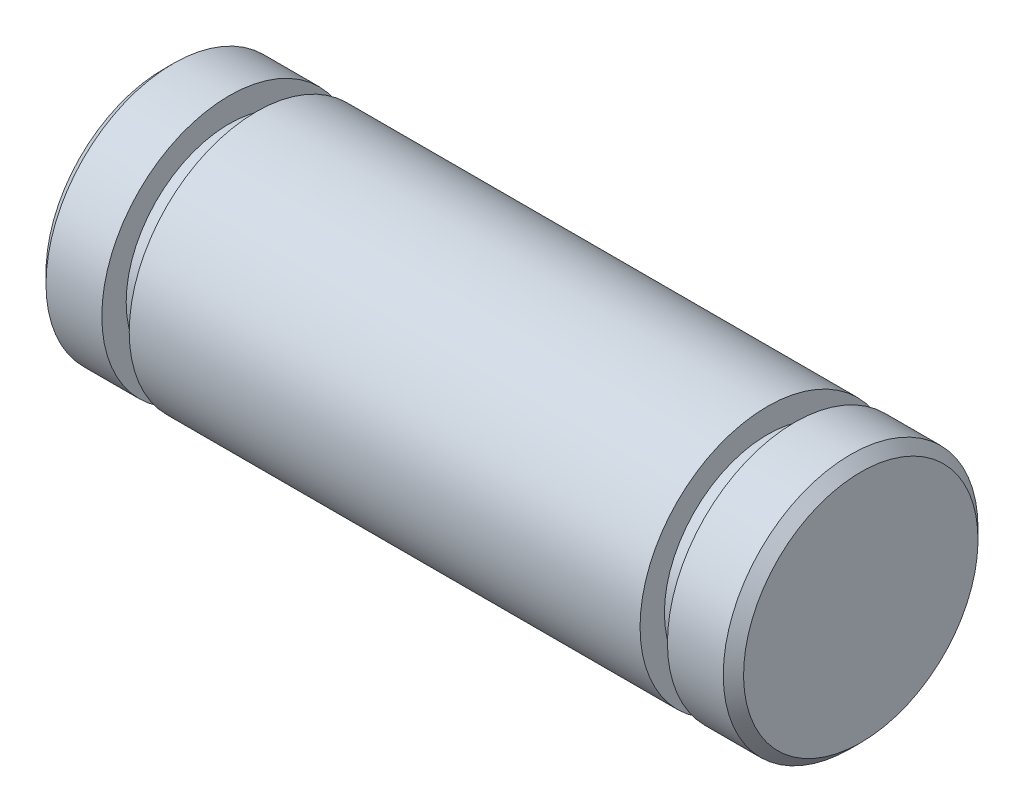
ISO-10303-21;
HEADER;
FILE_DESCRIPTION(('STEP AP214'),'2;1');
FILE_NAME('part.step','',(''),(''),'','','');
FILE_SCHEMA(('AUTOMOTIVE_DESIGN { 1 0 10303 214 1 1 1 1 }'));
ENDSEC;
DATA;
#1=APPLICATION_CONTEXT('core data for automotive mechanical design processes');
#2=APPLICATION_PROTOCOL_DEFINITION('international standard','automotive_design',2000,#1);
#3=PRODUCT_CONTEXT('',#1,'mechanical');
#4=PRODUCT('Part','Part','',(#3));
#5=PRODUCT_RELATED_PRODUCT_CATEGORY('part','',(#4));
#6=PRODUCT_DEFINITION_FORMATION('','',#4);
#7=PRODUCT_DEFINITION_CONTEXT('part definition',#1,'design');
#8=PRODUCT_DEFINITION('design','',#6,#7);
#9=PRODUCT_DEFINITION_SHAPE('','',#8);
#10=(LENGTH_UNIT() NAMED_UNIT(*) SI_UNIT(.MILLI.,.METRE.));
#11=(NAMED_UNIT(*) PLANE_ANGLE_UNIT() SI_UNIT($,.RADIAN.));
#12=(NAMED_UNIT(*) SI_UNIT($,.STERADIAN.) SOLID_ANGLE_UNIT());
#13=UNCERTAINTY_MEASURE_WITH_UNIT(LENGTH_MEASURE(1.E-05),#10,'distance_accuracy_value','');
#14=(GEOMETRIC_REPRESENTATION_CONTEXT(3) GLOBAL_UNCERTAINTY_ASSIGNED_CONTEXT((#13)) GLOBAL_UNIT_ASSIGNED_CONTEXT((#10,
#11,#12)) REPRESENTATION_CONTEXT('',''));
#15=CARTESIAN_POINT('',(0.,0.,0.));
#16=DIRECTION('',(0.,0.,1.));
#17=DIRECTION('',(1.,0.,0.));
#18=AXIS2_PLACEMENT_3D('',#15,#16,#17);
#19=CARTESIAN_POINT('',(13.0937,4.40055,0.));
#20=DIRECTION('',(-1.,0.,0.));
#21=DIRECTION('',(0.,0.,1.));
#22=AXIS2_PLACEMENT_3D('',#19,#20,#21);
#23=PLANE('',#22);
#24=CARTESIAN_POINT('',(13.0937000000699,0.,0.));
#25=DIRECTION('',(-1.,0.,0.));
#26=DIRECTION('',(0.,-1.,0.));
#27=AXIS2_PLACEMENT_3D('',#24,#25,#26);
#28=CIRCLE('',#27,4.40054999995709);
#29=CARTESIAN_POINT('',(13.0937000000699,-4.40054999995709,0.));
#30=VERTEX_POINT('',#29);
#31=EDGE_CURVE('E18',#30,#30,#28,.T.);
#32=ORIENTED_EDGE('',*,*,#31,.F.);
#33=EDGE_LOOP('',(#32));
#34=FACE_BOUND('',#33,.T.);
#35=ADVANCED_FACE('F15',(#34),#23,.F.);
#36=CARTESIAN_POINT('',(-13.0937,0.,0.));
#37=DIRECTION('',(1.,0.,0.));
#38=DIRECTION('',(0.,0.,-1.));
#39=AXIS2_PLACEMENT_3D('',#36,#37,#38);
#40=PLANE('',#39);
#41=CARTESIAN_POINT('',(-13.0937000000131,0.,0.));
#42=DIRECTION('',(1.,0.,0.));
#43=DIRECTION('',(0.,0.,-1.));
#44=AXIS2_PLACEMENT_3D('',#41,#42,#43);
#45=CIRCLE('',#44,4.40055000001394);
#46=CARTESIAN_POINT('',(-13.0937000000131,0.,-4.40055000001394));
#47=VERTEX_POINT('',#46);
#48=EDGE_CURVE('E59',#47,#47,#45,.T.);
#49=ORIENTED_EDGE('',*,*,#48,.F.);
#50=EDGE_LOOP('',(#49));
#51=FACE_BOUND('',#50,.T.);
#52=ADVANCED_FACE('F74',(#51),#40,.F.);
#53=CARTESIAN_POINT('',(12.7127000000087,0.,0.));
#54=DIRECTION('',(-1.,0.,0.));
#55=DIRECTION('',(0.,-1.,0.));
#56=AXIS2_PLACEMENT_3D('',#53,#54,#55);
#57=CONICAL_SURFACE('',#56,4.78155000001834,0.785398163397448);
#58=CARTESIAN_POINT('',(12.7127,0.,0.));
#59=DIRECTION('',(-1.,0.,0.));
#60=DIRECTION('',(0.,0.,1.));
#61=AXIS2_PLACEMENT_3D('',#58,#59,#60);
#62=CIRCLE('',#61,4.78155);
#63=CARTESIAN_POINT('',(12.7127,0.,4.78155));
#64=VERTEX_POINT('',#63);
#65=EDGE_CURVE('E62',#64,#64,#62,.T.);
#66=ORIENTED_EDGE('',*,*,#65,.F.);
#67=EDGE_LOOP('',(#66));
#68=FACE_BOUND('',#67,.T.);
#69=ORIENTED_EDGE('',*,*,#31,.T.);
#70=EDGE_LOOP('',(#69));
#71=FACE_BOUND('',#70,.T.);
#72=ADVANCED_FACE('F71',(#68,#71),#57,.T.);
#73=CARTESIAN_POINT('',(-12.7127000001224,0.,0.));
#74=DIRECTION('',(1.,0.,0.));
#75=DIRECTION('',(0.,0.,-1.));
#76=AXIS2_PLACEMENT_3D('',#73,#74,#75);
#77=CONICAL_SURFACE('',#76,4.78154999990466,0.785398163397448);
#78=ORIENTED_EDGE('',*,*,#48,.T.);
#79=EDGE_LOOP('',(#78));
#80=FACE_BOUND('',#79,.T.);
#81=CARTESIAN_POINT('',(-12.7127,0.,0.));
#82=DIRECTION('',(-1.,0.,0.));
#83=DIRECTION('',(0.,0.,1.));
#84=AXIS2_PLACEMENT_3D('',#81,#82,#83);
#85=CIRCLE('',#84,4.78155);
#86=CARTESIAN_POINT('',(-12.7127,0.,4.78155));
#87=VERTEX_POINT('',#86);
#88=EDGE_CURVE('E58',#87,#87,#85,.F.);
#89=ORIENTED_EDGE('',*,*,#88,.F.);
#90=EDGE_LOOP('',(#89));
#91=FACE_BOUND('',#90,.T.);
#92=ADVANCED_FACE('F118',(#80,#91),#77,.T.);
#93=CARTESIAN_POINT('',(13.0937,0.,0.));
#94=DIRECTION('',(-1.,0.,0.));
#95=DIRECTION('',(0.,0.,1.));
#96=AXIS2_PLACEMENT_3D('',#93,#94,#95);
#97=CYLINDRICAL_SURFACE('',#96,4.78155);
#98=CARTESIAN_POINT('',(10.6172,0.,0.));
#99=DIRECTION('',(-1.,0.,0.));
#100=DIRECTION('',(0.,0.,1.));
#101=AXIS2_PLACEMENT_3D('',#98,#99,#100);
#102=CIRCLE('',#101,4.78155);
#103=CARTESIAN_POINT('',(10.6172,0.,4.78155));
#104=VERTEX_POINT('',#103);
#105=EDGE_CURVE('E55',#104,#104,#102,.F.);
#106=ORIENTED_EDGE('',*,*,#105,.T.);
#107=EDGE_LOOP('',(#106));
#108=FACE_BOUND('',#107,.T.);
#109=ORIENTED_EDGE('',*,*,#65,.T.);
#110=EDGE_LOOP('',(#109));
#111=FACE_BOUND('',#110,.T.);
#112=ADVANCED_FACE('F114',(#108,#111),#97,.T.);
#113=CARTESIAN_POINT('',(13.0937,0.,0.));
#114=DIRECTION('',(-1.,0.,0.));
#115=DIRECTION('',(0.,0.,1.));
#116=AXIS2_PLACEMENT_3D('',#113,#114,#115);
#117=CYLINDRICAL_SURFACE('',#116,4.78155);
#118=ORIENTED_EDGE('',*,*,#88,.T.);
#119=EDGE_LOOP('',(#118));
#120=FACE_BOUND('',#119,.T.);
#121=CARTESIAN_POINT('',(-10.6172,0.,0.));
#122=DIRECTION('',(-1.,0.,0.));
#123=DIRECTION('',(0.,0.,1.));
#124=AXIS2_PLACEMENT_3D('',#121,#122,#123);
#125=CIRCLE('',#124,4.78155);
#126=CARTESIAN_POINT('',(-10.6172,0.,4.78155));
#127=VERTEX_POINT('',#126);
#128=EDGE_CURVE('E51',#127,#127,#125,.T.);
#129=ORIENTED_EDGE('',*,*,#128,.T.);
#130=EDGE_LOOP('',(#129));
#131=FACE_BOUND('',#130,.T.);
#132=ADVANCED_FACE('F110',(#120,#131),#117,.T.);
#133=CARTESIAN_POINT('',(10.6172,3.86715,0.));
#134=DIRECTION('',(1.,0.,0.));
#135=DIRECTION('',(0.,0.,-1.));
#136=AXIS2_PLACEMENT_3D('',#133,#134,#135);
#137=PLANE('',#136);
#138=CARTESIAN_POINT('',(10.6172,0.,0.));
#139=DIRECTION('',(-1.,0.,0.));
#140=DIRECTION('',(0.,0.,1.));
#141=AXIS2_PLACEMENT_3D('',#138,#139,#140);
#142=CIRCLE('',#141,3.86715);
#143=CARTESIAN_POINT('',(10.6172,0.,3.86715));
#144=VERTEX_POINT('',#143);
#145=EDGE_CURVE('E47',#144,#144,#142,.T.);
#146=ORIENTED_EDGE('',*,*,#145,.F.);
#147=EDGE_LOOP('',(#146));
#148=FACE_BOUND('',#147,.T.);
#149=ORIENTED_EDGE('',*,*,#105,.F.);
#150=EDGE_LOOP('',(#149));
#151=FACE_BOUND('',#150,.T.);
#152=ADVANCED_FACE('F106',(#148,#151),#137,.F.);
#153=CARTESIAN_POINT('',(-10.6172,4.78155,0.));
#154=DIRECTION('',(-1.,0.,0.));
#155=DIRECTION('',(0.,0.,1.));
#156=AXIS2_PLACEMENT_3D('',#153,#154,#155);
#157=PLANE('',#156);
#158=ORIENTED_EDGE('',*,*,#128,.F.);
#159=EDGE_LOOP('',(#158));
#160=FACE_BOUND('',#159,.T.);
#161=CARTESIAN_POINT('',(-10.6172,0.,0.));
#162=DIRECTION('',(-1.,0.,0.));
#163=DIRECTION('',(0.,0.,1.));
#164=AXIS2_PLACEMENT_3D('',#161,#162,#163);
#165=CIRCLE('',#164,3.86715);
#166=CARTESIAN_POINT('',(-10.6172,0.,3.86715));
#167=VERTEX_POINT('',#166);
#168=EDGE_CURVE('E43',#167,#167,#165,.F.);
#169=ORIENTED_EDGE('',*,*,#168,.F.);
#170=EDGE_LOOP('',(#169));
#171=FACE_BOUND('',#170,.T.);
#172=ADVANCED_FACE('F102',(#160,#171),#157,.F.);
#173=CARTESIAN_POINT('',(13.0937,0.,0.));
#174=DIRECTION('',(-1.,0.,0.));
#175=DIRECTION('',(0.,0.,1.));
#176=AXIS2_PLACEMENT_3D('',#173,#174,#175);
#177=CYLINDRICAL_SURFACE('',#176,3.86715);
#178=CARTESIAN_POINT('',(9.5885,0.,0.));
#179=DIRECTION('',(-1.,0.,0.));
#180=DIRECTION('',(0.,0.,1.));
#181=AXIS2_PLACEMENT_3D('',#178,#179,#180);
#182=CIRCLE('',#181,3.86715);
#183=CARTESIAN_POINT('',(9.5885,0.,3.86715));
#184=VERTEX_POINT('',#183);
#185=EDGE_CURVE('E39',#184,#184,#182,.F.);
#186=ORIENTED_EDGE('',*,*,#185,.T.);
#187=EDGE_LOOP('',(#186));
#188=FACE_BOUND('',#187,.T.);
#189=ORIENTED_EDGE('',*,*,#145,.T.);
#190=EDGE_LOOP('',(#189));
#191=FACE_BOUND('',#190,.T.);
#192=ADVANCED_FACE('F98',(#188,#191),#177,.T.);
#193=CARTESIAN_POINT('',(13.0937,0.,0.));
#194=DIRECTION('',(-1.,0.,0.));
#195=DIRECTION('',(0.,0.,1.));
#196=AXIS2_PLACEMENT_3D('',#193,#194,#195);
#197=CYLINDRICAL_SURFACE('',#196,3.86715);
#198=ORIENTED_EDGE('',*,*,#168,.T.);
#199=EDGE_LOOP('',(#198));
#200=FACE_BOUND('',#199,.T.);
#201=CARTESIAN_POINT('',(-9.5885,0.,0.));
#202=DIRECTION('',(-1.,0.,0.));
#203=DIRECTION('',(0.,0.,1.));
#204=AXIS2_PLACEMENT_3D('',#201,#202,#203);
#205=CIRCLE('',#204,3.86715);
#206=CARTESIAN_POINT('',(-9.5885,0.,3.86715));
#207=VERTEX_POINT('',#206);
#208=EDGE_CURVE('E30',#207,#207,#205,.T.);
#209=ORIENTED_EDGE('',*,*,#208,.T.);
#210=EDGE_LOOP('',(#209));
#211=FACE_BOUND('',#210,.T.);
#212=ADVANCED_FACE('F94',(#200,#211),#197,.T.);
#213=CARTESIAN_POINT('',(9.5885,4.78155,0.));
#214=DIRECTION('',(-1.,0.,0.));
#215=DIRECTION('',(0.,0.,1.));
#216=AXIS2_PLACEMENT_3D('',#213,#214,#215);
#217=PLANE('',#216);
#218=CARTESIAN_POINT('',(9.5885,0.,0.));
#219=DIRECTION('',(-1.,0.,0.));
#220=DIRECTION('',(0.,0.,1.));
#221=AXIS2_PLACEMENT_3D('',#218,#219,#220);
#222=CIRCLE('',#221,4.78155);
#223=CARTESIAN_POINT('',(9.5885,0.,4.78155));
#224=VERTEX_POINT('',#223);
#225=EDGE_CURVE('E23',#224,#224,#222,.T.);
#226=ORIENTED_EDGE('',*,*,#225,.F.);
#227=EDGE_LOOP('',(#226));
#228=FACE_BOUND('',#227,.T.);
#229=ORIENTED_EDGE('',*,*,#185,.F.);
#230=EDGE_LOOP('',(#229));
#231=FACE_BOUND('',#230,.T.);
#232=ADVANCED_FACE('F87',(#228,#231),#217,.F.);
#233=CARTESIAN_POINT('',(-9.5885,3.86715,0.));
#234=DIRECTION('',(1.,0.,0.));
#235=DIRECTION('',(0.,0.,-1.));
#236=AXIS2_PLACEMENT_3D('',#233,#234,#235);
#237=PLANE('',#236);
#238=ORIENTED_EDGE('',*,*,#208,.F.);
#239=EDGE_LOOP('',(#238));
#240=FACE_BOUND('',#239,.T.);
#241=CARTESIAN_POINT('',(-9.5885,0.,0.));
#242=DIRECTION('',(-1.,0.,0.));
#243=DIRECTION('',(0.,0.,1.));
#244=AXIS2_PLACEMENT_3D('',#241,#242,#243);
#245=CIRCLE('',#244,4.78155);
#246=CARTESIAN_POINT('',(-9.5885,0.,4.78155));
#247=VERTEX_POINT('',#246);
#248=EDGE_CURVE('E10',#247,#247,#245,.F.);
#249=ORIENTED_EDGE('',*,*,#248,.F.);
#250=EDGE_LOOP('',(#249));
#251=FACE_BOUND('',#250,.T.);
#252=ADVANCED_FACE('F82',(#240,#251),#237,.F.);
#253=CARTESIAN_POINT('',(13.0937,0.,0.));
#254=DIRECTION('',(-1.,0.,0.));
#255=DIRECTION('',(0.,0.,1.));
#256=AXIS2_PLACEMENT_3D('',#253,#254,#255);
#257=CYLINDRICAL_SURFACE('',#256,4.78155);
#258=ORIENTED_EDGE('',*,*,#248,.T.);
#259=EDGE_LOOP('',(#258));
#260=FACE_BOUND('',#259,.T.);
#261=ORIENTED_EDGE('',*,*,#225,.T.);
#262=EDGE_LOOP('',(#261));
#263=FACE_BOUND('',#262,.T.);
#264=ADVANCED_FACE('F80',(#260,#263),#257,.T.);
#265=CLOSED_SHELL('',(#35,#52,#72,#92,#112,#132,#152,#172,#192,#212,#232,#252,#264));
#266=MANIFOLD_SOLID_BREP('B1',#265);
#267=ADVANCED_BREP_SHAPE_REPRESENTATION('',(#18,#266),#14);
#268=SHAPE_DEFINITION_REPRESENTATION(#9,#267);
ENDSEC;
END-ISO-10303-21;
